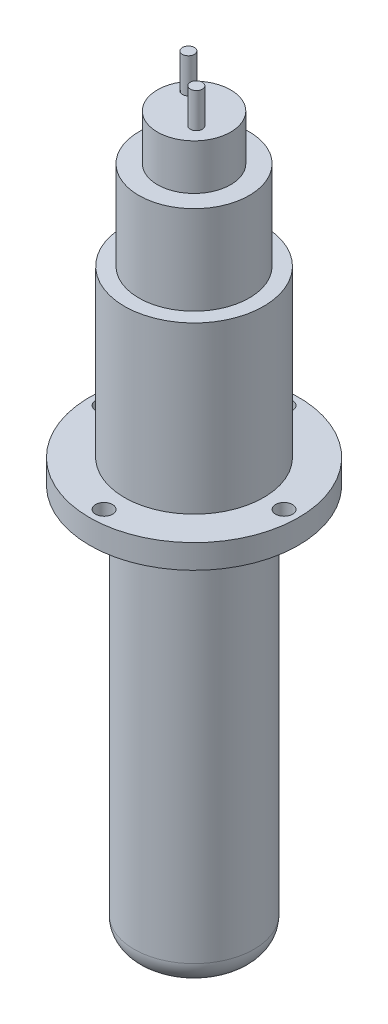
ISO-10303-21;
HEADER;
FILE_DESCRIPTION(('STEP AP214'),'2;1');
FILE_NAME('part.step','',(''),(''),'','','');
FILE_SCHEMA(('AUTOMOTIVE_DESIGN { 1 0 10303 214 1 1 1 1 }'));
ENDSEC;
DATA;
#1=APPLICATION_CONTEXT('core data for automotive mechanical design processes');
#2=APPLICATION_PROTOCOL_DEFINITION('international standard','automotive_design',2000,#1);
#3=PRODUCT_CONTEXT('',#1,'mechanical');
#4=PRODUCT('Part','Part','',(#3));
#5=PRODUCT_RELATED_PRODUCT_CATEGORY('part','',(#4));
#6=PRODUCT_DEFINITION_FORMATION('','',#4);
#7=PRODUCT_DEFINITION_CONTEXT('part definition',#1,'design');
#8=PRODUCT_DEFINITION('design','',#6,#7);
#9=PRODUCT_DEFINITION_SHAPE('','',#8);
#10=(LENGTH_UNIT() NAMED_UNIT(*) SI_UNIT(.MILLI.,.METRE.));
#11=(NAMED_UNIT(*) PLANE_ANGLE_UNIT() SI_UNIT($,.RADIAN.));
#12=(NAMED_UNIT(*) SI_UNIT($,.STERADIAN.) SOLID_ANGLE_UNIT());
#13=UNCERTAINTY_MEASURE_WITH_UNIT(LENGTH_MEASURE(1.E-05),#10,'distance_accuracy_value','');
#14=(GEOMETRIC_REPRESENTATION_CONTEXT(3) GLOBAL_UNCERTAINTY_ASSIGNED_CONTEXT((#13)) GLOBAL_UNIT_ASSIGNED_CONTEXT((#10,
#11,#12)) REPRESENTATION_CONTEXT('',''));
#15=CARTESIAN_POINT('',(0.,0.,0.));
#16=DIRECTION('',(0.,0.,1.));
#17=DIRECTION('',(1.,0.,0.));
#18=AXIS2_PLACEMENT_3D('',#15,#16,#17);
#19=CARTESIAN_POINT('',(0.,5.08,0.));
#20=DIRECTION('',(0.,-1.,0.));
#21=DIRECTION('',(0.,0.,-1.));
#22=AXIS2_PLACEMENT_3D('',#19,#20,#21);
#23=CYLINDRICAL_SURFACE('',#22,22.098);
#24=CARTESIAN_POINT('',(0.,5.08,0.));
#25=DIRECTION('',(0.,1.,0.));
#26=DIRECTION('',(0.,0.,1.));
#27=AXIS2_PLACEMENT_3D('',#24,#25,#26);
#28=CIRCLE('',#27,22.098);
#29=CARTESIAN_POINT('',(0.,5.08,22.098));
#30=VERTEX_POINT('',#29);
#31=EDGE_CURVE('E66',#30,#30,#28,.T.);
#32=ORIENTED_EDGE('',*,*,#31,.F.);
#33=EDGE_LOOP('',(#32));
#34=FACE_BOUND('',#33,.T.);
#35=CARTESIAN_POINT('',(0.,0.,0.));
#36=DIRECTION('',(0.,1.,0.));
#37=DIRECTION('',(0.,0.,1.));
#38=AXIS2_PLACEMENT_3D('',#35,#36,#37);
#39=CIRCLE('',#38,22.098);
#40=CARTESIAN_POINT('',(0.,0.,22.098));
#41=VERTEX_POINT('',#40);
#42=EDGE_CURVE('E63',#41,#41,#39,.T.);
#43=ORIENTED_EDGE('',*,*,#42,.T.);
#44=EDGE_LOOP('',(#43));
#45=FACE_BOUND('',#44,.T.);
#46=ADVANCED_FACE('F30',(#34,#45),#23,.T.);
#47=CARTESIAN_POINT('',(0.,5.08,0.));
#48=DIRECTION('',(0.,1.,0.));
#49=DIRECTION('',(0.,0.,1.));
#50=AXIS2_PLACEMENT_3D('',#47,#48,#49);
#51=PLANE('',#50);
#52=CARTESIAN_POINT('',(-19.05,5.08,0.));
#53=DIRECTION('',(0.,1.,0.));
#54=DIRECTION('',(1.,0.,0.));
#55=AXIS2_PLACEMENT_3D('',#52,#53,#54);
#56=CIRCLE('',#55,1.7907);
#57=CARTESIAN_POINT('',(-17.2593,5.08,0.));
#58=VERTEX_POINT('',#57);
#59=EDGE_CURVE('E58',#58,#58,#56,.T.);
#60=ORIENTED_EDGE('',*,*,#59,.F.);
#61=EDGE_LOOP('',(#60));
#62=FACE_BOUND('',#61,.T.);
#63=CARTESIAN_POINT('',(0.,5.08,19.05));
#64=DIRECTION('',(0.,1.,0.));
#65=DIRECTION('',(0.,0.,-1.));
#66=AXIS2_PLACEMENT_3D('',#63,#64,#65);
#67=CIRCLE('',#66,1.7907);
#68=CARTESIAN_POINT('',(0.,5.08,17.2593));
#69=VERTEX_POINT('',#68);
#70=EDGE_CURVE('E102',#69,#69,#67,.T.);
#71=ORIENTED_EDGE('',*,*,#70,.F.);
#72=EDGE_LOOP('',(#71));
#73=FACE_BOUND('',#72,.T.);
#74=CARTESIAN_POINT('',(19.05,5.08,-1.99538158514885E-13));
#75=DIRECTION('',(0.,1.,0.));
#76=DIRECTION('',(-1.,0.,0.));
#77=AXIS2_PLACEMENT_3D('',#74,#75,#76);
#78=CIRCLE('',#77,1.7907);
#79=CARTESIAN_POINT('',(17.2593,5.08,-1.80781571614486E-13));
#80=VERTEX_POINT('',#79);
#81=EDGE_CURVE('E99',#80,#80,#78,.T.);
#82=ORIENTED_EDGE('',*,*,#81,.F.);
#83=EDGE_LOOP('',(#82));
#84=FACE_BOUND('',#83,.T.);
#85=CARTESIAN_POINT('',(0.,5.08,-19.05));
#86=DIRECTION('',(0.,1.,0.));
#87=DIRECTION('',(0.,0.,1.));
#88=AXIS2_PLACEMENT_3D('',#85,#86,#87);
#89=CIRCLE('',#88,1.7907);
#90=CARTESIAN_POINT('',(0.,5.08,-17.2593));
#91=VERTEX_POINT('',#90);
#92=EDGE_CURVE('E51',#91,#91,#89,.T.);
#93=ORIENTED_EDGE('',*,*,#92,.F.);
#94=EDGE_LOOP('',(#93));
#95=FACE_BOUND('',#94,.T.);
#96=CARTESIAN_POINT('',(0.,5.08,0.));
#97=DIRECTION('',(0.,1.,0.));
#98=DIRECTION('',(0.,0.,1.));
#99=AXIS2_PLACEMENT_3D('',#96,#97,#98);
#100=CIRCLE('',#99,14.732);
#101=CARTESIAN_POINT('',(0.,5.08,14.732));
#102=VERTEX_POINT('',#101);
#103=EDGE_CURVE('E70',#102,#102,#100,.T.);
#104=ORIENTED_EDGE('',*,*,#103,.F.);
#105=EDGE_LOOP('',(#104));
#106=FACE_BOUND('',#105,.T.);
#107=ORIENTED_EDGE('',*,*,#31,.T.);
#108=EDGE_LOOP('',(#107));
#109=FACE_BOUND('',#108,.T.);
#110=ADVANCED_FACE('F111',(#62,#73,#84,#95,#106,#109),#51,.T.);
#111=CARTESIAN_POINT('',(0.,0.,0.));
#112=DIRECTION('',(0.,1.,0.));
#113=DIRECTION('',(0.,0.,1.));
#114=AXIS2_PLACEMENT_3D('',#111,#112,#113);
#115=PLANE('',#114);
#116=CARTESIAN_POINT('',(0.,0.,0.));
#117=DIRECTION('',(0.,1.,0.));
#118=DIRECTION('',(0.,0.,1.));
#119=AXIS2_PLACEMENT_3D('',#116,#117,#118);
#120=CIRCLE('',#119,12.7);
#121=CARTESIAN_POINT('',(0.,0.,12.7));
#122=VERTEX_POINT('',#121);
#123=EDGE_CURVE('E41',#122,#122,#120,.F.);
#124=ORIENTED_EDGE('',*,*,#123,.F.);
#125=EDGE_LOOP('',(#124));
#126=FACE_BOUND('',#125,.T.);
#127=CARTESIAN_POINT('',(-19.05,0.,0.));
#128=DIRECTION('',(0.,1.,0.));
#129=DIRECTION('',(0.,0.,1.));
#130=AXIS2_PLACEMENT_3D('',#127,#128,#129);
#131=CIRCLE('',#130,1.7907);
#132=CARTESIAN_POINT('',(-19.05,0.,1.79070000000007));
#133=VERTEX_POINT('',#132);
#134=EDGE_CURVE('E48',#133,#133,#131,.T.);
#135=ORIENTED_EDGE('',*,*,#134,.T.);
#136=EDGE_LOOP('',(#135));
#137=FACE_BOUND('',#136,.T.);
#138=CARTESIAN_POINT('',(0.,0.,19.05));
#139=DIRECTION('',(0.,1.,0.));
#140=DIRECTION('',(0.,0.,1.));
#141=AXIS2_PLACEMENT_3D('',#138,#139,#140);
#142=CIRCLE('',#141,1.7907);
#143=CARTESIAN_POINT('',(0.,0.,20.8407));
#144=VERTEX_POINT('',#143);
#145=EDGE_CURVE('E52',#144,#144,#142,.T.);
#146=ORIENTED_EDGE('',*,*,#145,.T.);
#147=EDGE_LOOP('',(#146));
#148=FACE_BOUND('',#147,.T.);
#149=CARTESIAN_POINT('',(19.05,0.,-1.99538158514885E-13));
#150=DIRECTION('',(0.,1.,0.));
#151=DIRECTION('',(0.,0.,1.));
#152=AXIS2_PLACEMENT_3D('',#149,#150,#151);
#153=CIRCLE('',#152,1.7907);
#154=CARTESIAN_POINT('',(19.05,0.,1.7906999999998));
#155=VERTEX_POINT('',#154);
#156=EDGE_CURVE('E55',#155,#155,#153,.T.);
#157=ORIENTED_EDGE('',*,*,#156,.T.);
#158=EDGE_LOOP('',(#157));
#159=FACE_BOUND('',#158,.T.);
#160=CARTESIAN_POINT('',(0.,0.,-19.05));
#161=DIRECTION('',(0.,1.,0.));
#162=DIRECTION('',(0.,0.,1.));
#163=AXIS2_PLACEMENT_3D('',#160,#161,#162);
#164=CIRCLE('',#163,1.7907);
#165=CARTESIAN_POINT('',(0.,0.,-17.2593));
#166=VERTEX_POINT('',#165);
#167=EDGE_CURVE('E59',#166,#166,#164,.T.);
#168=ORIENTED_EDGE('',*,*,#167,.T.);
#169=EDGE_LOOP('',(#168));
#170=FACE_BOUND('',#169,.T.);
#171=ORIENTED_EDGE('',*,*,#42,.F.);
#172=EDGE_LOOP('',(#171));
#173=FACE_BOUND('',#172,.T.);
#174=ADVANCED_FACE('F114',(#126,#137,#148,#159,#170,#173),#115,.F.);
#175=CARTESIAN_POINT('',(0.,40.132,0.));
#176=DIRECTION('',(0.,-1.,0.));
#177=DIRECTION('',(0.,0.,-1.));
#178=AXIS2_PLACEMENT_3D('',#175,#176,#177);
#179=CYLINDRICAL_SURFACE('',#178,14.732);
#180=CARTESIAN_POINT('',(0.,40.132,0.));
#181=DIRECTION('',(0.,1.,0.));
#182=DIRECTION('',(0.,0.,1.));
#183=AXIS2_PLACEMENT_3D('',#180,#181,#182);
#184=CIRCLE('',#183,14.732);
#185=CARTESIAN_POINT('',(0.,40.132,14.732));
#186=VERTEX_POINT('',#185);
#187=EDGE_CURVE('E67',#186,#186,#184,.T.);
#188=ORIENTED_EDGE('',*,*,#187,.F.);
#189=EDGE_LOOP('',(#188));
#190=FACE_BOUND('',#189,.T.);
#191=ORIENTED_EDGE('',*,*,#103,.T.);
#192=EDGE_LOOP('',(#191));
#193=FACE_BOUND('',#192,.T.);
#194=ADVANCED_FACE('F131',(#190,#193),#179,.T.);
#195=CARTESIAN_POINT('',(0.,40.132,0.));
#196=DIRECTION('',(0.,1.,0.));
#197=DIRECTION('',(0.,0.,1.));
#198=AXIS2_PLACEMENT_3D('',#195,#196,#197);
#199=PLANE('',#198);
#200=CARTESIAN_POINT('',(0.,40.132,0.));
#201=DIRECTION('',(0.,1.,0.));
#202=DIRECTION('',(0.,0.,1.));
#203=AXIS2_PLACEMENT_3D('',#200,#201,#202);
#204=CIRCLE('',#203,11.684);
#205=CARTESIAN_POINT('',(0.,40.132,11.684));
#206=VERTEX_POINT('',#205);
#207=EDGE_CURVE('E73',#206,#206,#204,.T.);
#208=ORIENTED_EDGE('',*,*,#207,.F.);
#209=EDGE_LOOP('',(#208));
#210=FACE_BOUND('',#209,.T.);
#211=ORIENTED_EDGE('',*,*,#187,.T.);
#212=EDGE_LOOP('',(#211));
#213=FACE_BOUND('',#212,.T.);
#214=ADVANCED_FACE('F137',(#210,#213),#199,.T.);
#215=CARTESIAN_POINT('',(0.,58.928,0.));
#216=DIRECTION('',(0.,-1.,0.));
#217=DIRECTION('',(0.,0.,-1.));
#218=AXIS2_PLACEMENT_3D('',#215,#216,#217);
#219=CYLINDRICAL_SURFACE('',#218,11.684);
#220=CARTESIAN_POINT('',(0.,58.928,0.));
#221=DIRECTION('',(0.,1.,0.));
#222=DIRECTION('',(0.,0.,1.));
#223=AXIS2_PLACEMENT_3D('',#220,#221,#222);
#224=CIRCLE('',#223,11.684);
#225=CARTESIAN_POINT('',(0.,58.928,11.684));
#226=VERTEX_POINT('',#225);
#227=EDGE_CURVE('E76',#226,#226,#224,.T.);
#228=ORIENTED_EDGE('',*,*,#227,.F.);
#229=EDGE_LOOP('',(#228));
#230=FACE_BOUND('',#229,.T.);
#231=ORIENTED_EDGE('',*,*,#207,.T.);
#232=EDGE_LOOP('',(#231));
#233=FACE_BOUND('',#232,.T.);
#234=ADVANCED_FACE('F145',(#230,#233),#219,.T.);
#235=CARTESIAN_POINT('',(0.,58.928,0.));
#236=DIRECTION('',(0.,1.,0.));
#237=DIRECTION('',(0.,0.,1.));
#238=AXIS2_PLACEMENT_3D('',#235,#236,#237);
#239=PLANE('',#238);
#240=CARTESIAN_POINT('',(0.,58.928,0.));
#241=DIRECTION('',(0.,1.,0.));
#242=DIRECTION('',(0.,0.,1.));
#243=AXIS2_PLACEMENT_3D('',#240,#241,#242);
#244=CIRCLE('',#243,7.747);
#245=CARTESIAN_POINT('',(0.,58.928,7.747));
#246=VERTEX_POINT('',#245);
#247=EDGE_CURVE('E45',#246,#246,#244,.T.);
#248=ORIENTED_EDGE('',*,*,#247,.F.);
#249=EDGE_LOOP('',(#248));
#250=FACE_BOUND('',#249,.T.);
#251=ORIENTED_EDGE('',*,*,#227,.T.);
#252=EDGE_LOOP('',(#251));
#253=FACE_BOUND('',#252,.T.);
#254=ADVANCED_FACE('F149',(#250,#253),#239,.T.);
#255=CARTESIAN_POINT('',(0.,68.58,0.));
#256=DIRECTION('',(0.,-1.,0.));
#257=DIRECTION('',(0.,0.,-1.));
#258=AXIS2_PLACEMENT_3D('',#255,#256,#257);
#259=CYLINDRICAL_SURFACE('',#258,7.747);
#260=CARTESIAN_POINT('',(0.,68.58,0.));
#261=DIRECTION('',(0.,1.,0.));
#262=DIRECTION('',(0.,0.,1.));
#263=AXIS2_PLACEMENT_3D('',#260,#261,#262);
#264=CIRCLE('',#263,7.747);
#265=CARTESIAN_POINT('',(0.,68.58,7.747));
#266=VERTEX_POINT('',#265);
#267=EDGE_CURVE('E81',#266,#266,#264,.T.);
#268=ORIENTED_EDGE('',*,*,#267,.F.);
#269=EDGE_LOOP('',(#268));
#270=FACE_BOUND('',#269,.T.);
#271=ORIENTED_EDGE('',*,*,#247,.T.);
#272=EDGE_LOOP('',(#271));
#273=FACE_BOUND('',#272,.T.);
#274=ADVANCED_FACE('F153',(#270,#273),#259,.T.);
#275=CARTESIAN_POINT('',(0.,68.58,0.));
#276=DIRECTION('',(0.,1.,0.));
#277=DIRECTION('',(0.,0.,1.));
#278=AXIS2_PLACEMENT_3D('',#275,#276,#277);
#279=PLANE('',#278);
#280=CARTESIAN_POINT('',(2.97002677292824,68.58,2.48175750236612));
#281=DIRECTION('',(0.,1.,0.));
#282=DIRECTION('',(0.,0.,1.));
#283=AXIS2_PLACEMENT_3D('',#280,#281,#282);
#284=CIRCLE('',#283,1.27);
#285=CARTESIAN_POINT('',(2.97002677292824,68.58,3.75175750236612));
#286=VERTEX_POINT('',#285);
#287=EDGE_CURVE('E62',#286,#286,#284,.T.);
#288=ORIENTED_EDGE('',*,*,#287,.F.);
#289=EDGE_LOOP('',(#288));
#290=FACE_BOUND('',#289,.T.);
#291=CARTESIAN_POINT('',(-4.24340631789732,68.58,-3.04439882199858));
#292=DIRECTION('',(0.,1.,0.));
#293=DIRECTION('',(0.,0.,1.));
#294=AXIS2_PLACEMENT_3D('',#291,#292,#293);
#295=CIRCLE('',#294,1.27);
#296=CARTESIAN_POINT('',(-4.24340631789732,68.58,-1.77439882199858));
#297=VERTEX_POINT('',#296);
#298=EDGE_CURVE('E87',#297,#297,#295,.T.);
#299=ORIENTED_EDGE('',*,*,#298,.F.);
#300=EDGE_LOOP('',(#299));
#301=FACE_BOUND('',#300,.T.);
#302=ORIENTED_EDGE('',*,*,#267,.T.);
#303=EDGE_LOOP('',(#302));
#304=FACE_BOUND('',#303,.T.);
#305=ADVANCED_FACE('F157',(#290,#301,#304),#279,.T.);
#306=CARTESIAN_POINT('',(-4.24340631789732,75.946,-3.04439882199858));
#307=DIRECTION('',(0.,-1.,0.));
#308=DIRECTION('',(0.,0.,-1.));
#309=AXIS2_PLACEMENT_3D('',#306,#307,#308);
#310=CYLINDRICAL_SURFACE('',#309,1.27);
#311=CARTESIAN_POINT('',(-4.24340631789732,75.946,-3.04439882199858));
#312=DIRECTION('',(0.,1.,0.));
#313=DIRECTION('',(0.,0.,1.));
#314=AXIS2_PLACEMENT_3D('',#311,#312,#313);
#315=CIRCLE('',#314,1.27);
#316=CARTESIAN_POINT('',(-4.24340631789732,75.946,-1.77439882199858));
#317=VERTEX_POINT('',#316);
#318=EDGE_CURVE('E86',#317,#317,#315,.T.);
#319=ORIENTED_EDGE('',*,*,#318,.F.);
#320=EDGE_LOOP('',(#319));
#321=FACE_BOUND('',#320,.T.);
#322=ORIENTED_EDGE('',*,*,#298,.T.);
#323=EDGE_LOOP('',(#322));
#324=FACE_BOUND('',#323,.T.);
#325=ADVANCED_FACE('F161',(#321,#324),#310,.T.);
#326=CARTESIAN_POINT('',(-4.24340631789732,75.946,-3.04439882199858));
#327=DIRECTION('',(0.,1.,0.));
#328=DIRECTION('',(0.,0.,1.));
#329=AXIS2_PLACEMENT_3D('',#326,#327,#328);
#330=PLANE('',#329);
#331=ORIENTED_EDGE('',*,*,#318,.T.);
#332=EDGE_LOOP('',(#331));
#333=FACE_BOUND('',#332,.T.);
#334=ADVANCED_FACE('F165',(#333),#330,.T.);
#335=CARTESIAN_POINT('',(2.97002677292824,75.946,2.48175750236612));
#336=DIRECTION('',(0.,-1.,0.));
#337=DIRECTION('',(0.,0.,-1.));
#338=AXIS2_PLACEMENT_3D('',#335,#336,#337);
#339=CYLINDRICAL_SURFACE('',#338,1.27);
#340=CARTESIAN_POINT('',(2.97002677292824,75.946,2.48175750236612));
#341=DIRECTION('',(0.,1.,0.));
#342=DIRECTION('',(0.,0.,1.));
#343=AXIS2_PLACEMENT_3D('',#340,#341,#342);
#344=CIRCLE('',#343,1.27);
#345=CARTESIAN_POINT('',(2.97002677292824,75.946,3.75175750236612));
#346=VERTEX_POINT('',#345);
#347=EDGE_CURVE('E90',#346,#346,#344,.T.);
#348=ORIENTED_EDGE('',*,*,#347,.F.);
#349=EDGE_LOOP('',(#348));
#350=FACE_BOUND('',#349,.T.);
#351=ORIENTED_EDGE('',*,*,#287,.T.);
#352=EDGE_LOOP('',(#351));
#353=FACE_BOUND('',#352,.T.);
#354=ADVANCED_FACE('F169',(#350,#353),#339,.T.);
#355=CARTESIAN_POINT('',(2.97002677292824,75.946,2.48175750236612));
#356=DIRECTION('',(0.,1.,0.));
#357=DIRECTION('',(0.,0.,1.));
#358=AXIS2_PLACEMENT_3D('',#355,#356,#357);
#359=PLANE('',#358);
#360=ORIENTED_EDGE('',*,*,#347,.T.);
#361=EDGE_LOOP('',(#360));
#362=FACE_BOUND('',#361,.T.);
#363=ADVANCED_FACE('F173',(#362),#359,.T.);
#364=CARTESIAN_POINT('',(0.,-2.286,-19.05));
#365=DIRECTION('',(0.,1.,0.));
#366=DIRECTION('',(0.,0.,1.));
#367=AXIS2_PLACEMENT_3D('',#364,#365,#366);
#368=CYLINDRICAL_SURFACE('',#367,1.7907);
#369=ORIENTED_EDGE('',*,*,#92,.T.);
#370=EDGE_LOOP('',(#369));
#371=FACE_BOUND('',#370,.T.);
#372=ORIENTED_EDGE('',*,*,#167,.F.);
#373=EDGE_LOOP('',(#372));
#374=FACE_BOUND('',#373,.T.);
#375=ADVANCED_FACE('F177',(#371,#374),#368,.F.);
#376=CARTESIAN_POINT('',(19.05,-2.286,-1.99538158514885E-13));
#377=DIRECTION('',(0.,1.,0.));
#378=DIRECTION('',(0.,0.,1.));
#379=AXIS2_PLACEMENT_3D('',#376,#377,#378);
#380=CYLINDRICAL_SURFACE('',#379,1.7907);
#381=ORIENTED_EDGE('',*,*,#81,.T.);
#382=EDGE_LOOP('',(#381));
#383=FACE_BOUND('',#382,.T.);
#384=ORIENTED_EDGE('',*,*,#156,.F.);
#385=EDGE_LOOP('',(#384));
#386=FACE_BOUND('',#385,.T.);
#387=ADVANCED_FACE('F181',(#383,#386),#380,.F.);
#388=CARTESIAN_POINT('',(0.,-2.286,19.05));
#389=DIRECTION('',(0.,1.,0.));
#390=DIRECTION('',(0.,0.,1.));
#391=AXIS2_PLACEMENT_3D('',#388,#389,#390);
#392=CYLINDRICAL_SURFACE('',#391,1.7907);
#393=ORIENTED_EDGE('',*,*,#70,.T.);
#394=EDGE_LOOP('',(#393));
#395=FACE_BOUND('',#394,.T.);
#396=ORIENTED_EDGE('',*,*,#145,.F.);
#397=EDGE_LOOP('',(#396));
#398=FACE_BOUND('',#397,.T.);
#399=ADVANCED_FACE('F185',(#395,#398),#392,.F.);
#400=CARTESIAN_POINT('',(-19.05,-2.286,0.));
#401=DIRECTION('',(0.,1.,0.));
#402=DIRECTION('',(0.,0.,1.));
#403=AXIS2_PLACEMENT_3D('',#400,#401,#402);
#404=CYLINDRICAL_SURFACE('',#403,1.7907);
#405=ORIENTED_EDGE('',*,*,#59,.T.);
#406=EDGE_LOOP('',(#405));
#407=FACE_BOUND('',#406,.T.);
#408=ORIENTED_EDGE('',*,*,#134,.F.);
#409=EDGE_LOOP('',(#408));
#410=FACE_BOUND('',#409,.T.);
#411=ADVANCED_FACE('F108',(#407,#410),#404,.F.);
#412=CARTESIAN_POINT('',(0.,-83.82,0.));
#413=DIRECTION('',(0.,1.,0.));
#414=DIRECTION('',(0.,0.,1.));
#415=AXIS2_PLACEMENT_3D('',#412,#413,#414);
#416=CYLINDRICAL_SURFACE('',#415,12.7);
#417=CARTESIAN_POINT('',(0.,-78.74,0.));
#418=DIRECTION('',(0.,-1.,0.));
#419=DIRECTION('',(0.,0.,-1.));
#420=AXIS2_PLACEMENT_3D('',#417,#418,#419);
#421=CIRCLE('',#420,12.7);
#422=CARTESIAN_POINT('',(0.,-78.74,-12.7));
#423=VERTEX_POINT('',#422);
#424=EDGE_CURVE('E10',#423,#423,#421,.F.);
#425=ORIENTED_EDGE('',*,*,#424,.T.);
#426=EDGE_LOOP('',(#425));
#427=FACE_BOUND('',#426,.T.);
#428=ORIENTED_EDGE('',*,*,#123,.T.);
#429=EDGE_LOOP('',(#428));
#430=FACE_BOUND('',#429,.T.);
#431=ADVANCED_FACE('F192',(#427,#430),#416,.T.);
#432=CARTESIAN_POINT('',(0.,-83.82,0.));
#433=DIRECTION('',(0.,-1.,0.));
#434=DIRECTION('',(0.,0.,-1.));
#435=AXIS2_PLACEMENT_3D('',#432,#433,#434);
#436=PLANE('',#435);
#437=CARTESIAN_POINT('',(0.,-83.82,0.));
#438=DIRECTION('',(0.,-1.,0.));
#439=DIRECTION('',(0.,0.,-1.));
#440=AXIS2_PLACEMENT_3D('',#437,#438,#439);
#441=CIRCLE('',#440,7.62);
#442=CARTESIAN_POINT('',(0.,-83.82,-7.62));
#443=VERTEX_POINT('',#442);
#444=EDGE_CURVE('E37',#443,#443,#441,.T.);
#445=ORIENTED_EDGE('',*,*,#444,.T.);
#446=EDGE_LOOP('',(#445));
#447=FACE_BOUND('',#446,.T.);
#448=ADVANCED_FACE('F195',(#447),#436,.T.);
#449=CARTESIAN_POINT('',(0.,-78.74,0.));
#450=DIRECTION('',(0.,-1.,0.));
#451=DIRECTION('',(0.,0.,-1.));
#452=AXIS2_PLACEMENT_3D('',#449,#450,#451);
#453=TOROIDAL_SURFACE('',#452,7.62,5.08);
#454=ORIENTED_EDGE('',*,*,#424,.F.);
#455=EDGE_LOOP('',(#454));
#456=FACE_BOUND('',#455,.T.);
#457=ORIENTED_EDGE('',*,*,#444,.F.);
#458=EDGE_LOOP('',(#457));
#459=FACE_BOUND('',#458,.T.);
#460=ADVANCED_FACE('F32',(#456,#459),#453,.T.);
#461=CLOSED_SHELL('',(#46,#110,#174,#194,#214,#234,#254,#274,#305,#325,#334,#354,#363,#375,#387,
#399,#411,#431,#448,#460));
#462=MANIFOLD_SOLID_BREP('B2',#461);
#463=ADVANCED_BREP_SHAPE_REPRESENTATION('',(#18,#462),#14);
#464=SHAPE_DEFINITION_REPRESENTATION(#9,#463);
ENDSEC;
END-ISO-10303-21;
